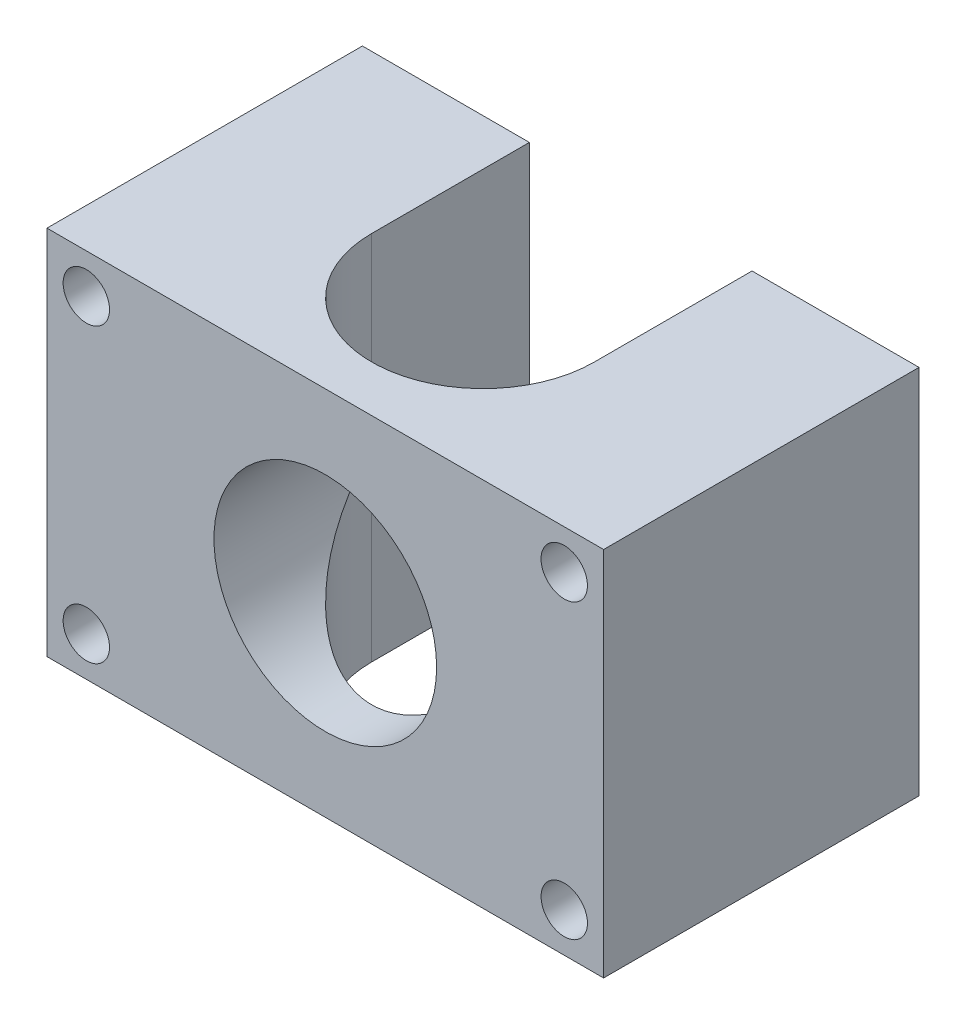
ISO-10303-21;
HEADER;
FILE_DESCRIPTION(('STEP AP214'),'2;1');
FILE_NAME('part.step','',(''),(''),'','','');
FILE_SCHEMA(('AUTOMOTIVE_DESIGN { 1 0 10303 214 1 1 1 1 }'));
ENDSEC;
DATA;
#1=APPLICATION_CONTEXT('core data for automotive mechanical design processes');
#2=APPLICATION_PROTOCOL_DEFINITION('international standard','automotive_design',2000,#1);
#3=PRODUCT_CONTEXT('',#1,'mechanical');
#4=PRODUCT('Part','Part','',(#3));
#5=PRODUCT_RELATED_PRODUCT_CATEGORY('part','',(#4));
#6=PRODUCT_DEFINITION_FORMATION('','',#4);
#7=PRODUCT_DEFINITION_CONTEXT('part definition',#1,'design');
#8=PRODUCT_DEFINITION('design','',#6,#7);
#9=PRODUCT_DEFINITION_SHAPE('','',#8);
#10=(LENGTH_UNIT() NAMED_UNIT(*) SI_UNIT(.MILLI.,.METRE.));
#11=(NAMED_UNIT(*) PLANE_ANGLE_UNIT() SI_UNIT($,.RADIAN.));
#12=(NAMED_UNIT(*) SI_UNIT($,.STERADIAN.) SOLID_ANGLE_UNIT());
#13=UNCERTAINTY_MEASURE_WITH_UNIT(LENGTH_MEASURE(1.E-05),#10,'distance_accuracy_value','');
#14=(GEOMETRIC_REPRESENTATION_CONTEXT(3) GLOBAL_UNCERTAINTY_ASSIGNED_CONTEXT((#13)) GLOBAL_UNIT_ASSIGNED_CONTEXT((#10,
#11,#12)) REPRESENTATION_CONTEXT('',''));
#15=CARTESIAN_POINT('',(0.,0.,0.));
#16=DIRECTION('',(0.,0.,1.));
#17=DIRECTION('',(1.,0.,0.));
#18=AXIS2_PLACEMENT_3D('',#15,#16,#17);
#19=CARTESIAN_POINT('',(0.,0.,0.));
#20=DIRECTION('',(0.,0.,-1.));
#21=DIRECTION('',(-1.,0.,0.));
#22=AXIS2_PLACEMENT_3D('',#19,#20,#21);
#23=PLANE('',#22);
#24=CARTESIAN_POINT('',(55.7573593128807,35.7573593128807,0.));
#25=DIRECTION('',(0.,0.,-1.));
#26=DIRECTION('',(-1.,0.,0.));
#27=AXIS2_PLACEMENT_3D('',#24,#25,#26);
#28=CIRCLE('',#27,2.5);
#29=CARTESIAN_POINT('',(53.2573593128807,35.7573593128807,0.));
#30=VERTEX_POINT('',#29);
#31=EDGE_CURVE('E197',#30,#30,#28,.F.);
#32=ORIENTED_EDGE('',*,*,#31,.T.);
#33=EDGE_LOOP('',(#32));
#34=FACE_BOUND('',#33,.T.);
#35=DIRECTION('',(1.,0.,0.));
#36=VECTOR('',#35,1.);
#37=CARTESIAN_POINT('',(0.,0.,0.));
#38=LINE('',#37,#36);
#39=CARTESIAN_POINT('',(42.,0.,0.));
#40=VERTEX_POINT('',#39);
#41=CARTESIAN_POINT('',(60.,0.,0.));
#42=VERTEX_POINT('',#41);
#43=EDGE_CURVE('E167',#40,#42,#38,.T.);
#44=ORIENTED_EDGE('',*,*,#43,.F.);
#45=DIRECTION('',(0.,-1.,0.));
#46=VECTOR('',#45,1.);
#47=CARTESIAN_POINT('',(42.,40.,0.));
#48=LINE('',#47,#46);
#49=CARTESIAN_POINT('',(42.,40.,0.));
#50=VERTEX_POINT('',#49);
#51=EDGE_CURVE('E144',#50,#40,#48,.T.);
#52=ORIENTED_EDGE('',*,*,#51,.F.);
#53=DIRECTION('',(-1.,0.,0.));
#54=VECTOR('',#53,1.);
#55=CARTESIAN_POINT('',(0.,40.,0.));
#56=LINE('',#55,#54);
#57=CARTESIAN_POINT('',(60.,40.,0.));
#58=VERTEX_POINT('',#57);
#59=EDGE_CURVE('E153',#58,#50,#56,.T.);
#60=ORIENTED_EDGE('',*,*,#59,.F.);
#61=DIRECTION('',(0.,1.,0.));
#62=VECTOR('',#61,1.);
#63=CARTESIAN_POINT('',(60.,0.,0.));
#64=LINE('',#63,#62);
#65=EDGE_CURVE('E172',#42,#58,#64,.T.);
#66=ORIENTED_EDGE('',*,*,#65,.F.);
#67=EDGE_LOOP('',(#44,#52,#60,#66));
#68=FACE_BOUND('',#67,.T.);
#69=CARTESIAN_POINT('',(55.7573593128807,4.24264068711928,0.));
#70=DIRECTION('',(0.,0.,-1.));
#71=DIRECTION('',(-1.,0.,0.));
#72=AXIS2_PLACEMENT_3D('',#69,#70,#71);
#73=CIRCLE('',#72,2.5);
#74=CARTESIAN_POINT('',(53.2573593128807,4.24264068711928,0.));
#75=VERTEX_POINT('',#74);
#76=EDGE_CURVE('E212',#75,#75,#73,.T.);
#77=ORIENTED_EDGE('',*,*,#76,.F.);
#78=EDGE_LOOP('',(#77));
#79=FACE_BOUND('',#78,.T.);
#80=ADVANCED_FACE('F39',(#34,#68,#79),#23,.T.);
#81=CARTESIAN_POINT('',(0.,0.,34.));
#82=DIRECTION('',(0.,0.,-1.));
#83=DIRECTION('',(-1.,0.,0.));
#84=AXIS2_PLACEMENT_3D('',#81,#82,#83);
#85=PLANE('',#84);
#86=CARTESIAN_POINT('',(55.7573593128807,4.24264068711928,34.));
#87=DIRECTION('',(0.,0.,1.));
#88=DIRECTION('',(1.,0.,0.));
#89=AXIS2_PLACEMENT_3D('',#86,#87,#88);
#90=CIRCLE('',#89,2.5);
#91=CARTESIAN_POINT('',(58.2573593128807,4.24264068711928,34.));
#92=VERTEX_POINT('',#91);
#93=EDGE_CURVE('E205',#92,#92,#90,.T.);
#94=ORIENTED_EDGE('',*,*,#93,.F.);
#95=EDGE_LOOP('',(#94));
#96=FACE_BOUND('',#95,.T.);
#97=CARTESIAN_POINT('',(55.7573593128807,35.7573593128807,34.));
#98=DIRECTION('',(0.,0.,-1.));
#99=DIRECTION('',(-1.,0.,0.));
#100=AXIS2_PLACEMENT_3D('',#97,#98,#99);
#101=CIRCLE('',#100,2.5);
#102=CARTESIAN_POINT('',(53.2573593128807,35.7573593128807,34.));
#103=VERTEX_POINT('',#102);
#104=EDGE_CURVE('E328',#103,#103,#101,.T.);
#105=ORIENTED_EDGE('',*,*,#104,.T.);
#106=EDGE_LOOP('',(#105));
#107=FACE_BOUND('',#106,.T.);
#108=CARTESIAN_POINT('',(4.24264068711928,4.24264068711928,34.));
#109=DIRECTION('',(0.,0.,-1.));
#110=DIRECTION('',(-1.,0.,0.));
#111=AXIS2_PLACEMENT_3D('',#108,#109,#110);
#112=CIRCLE('',#111,2.5);
#113=CARTESIAN_POINT('',(1.74264068711928,4.24264068711928,34.));
#114=VERTEX_POINT('',#113);
#115=EDGE_CURVE('E191',#114,#114,#112,.T.);
#116=ORIENTED_EDGE('',*,*,#115,.T.);
#117=EDGE_LOOP('',(#116));
#118=FACE_BOUND('',#117,.T.);
#119=CARTESIAN_POINT('',(30.,20.,34.));
#120=DIRECTION('',(0.,0.,1.));
#121=DIRECTION('',(1.,0.,0.));
#122=AXIS2_PLACEMENT_3D('',#119,#120,#121);
#123=CIRCLE('',#122,12.);
#124=CARTESIAN_POINT('',(42.,20.,34.));
#125=VERTEX_POINT('',#124);
#126=EDGE_CURVE('E116',#125,#125,#123,.T.);
#127=ORIENTED_EDGE('',*,*,#126,.F.);
#128=EDGE_LOOP('',(#127));
#129=FACE_BOUND('',#128,.T.);
#130=DIRECTION('',(0.,-1.,0.));
#131=VECTOR('',#130,1.);
#132=CARTESIAN_POINT('',(0.,0.,34.));
#133=LINE('',#132,#131);
#134=CARTESIAN_POINT('',(0.,40.,34.));
#135=VERTEX_POINT('',#134);
#136=CARTESIAN_POINT('',(0.,0.,34.));
#137=VERTEX_POINT('',#136);
#138=EDGE_CURVE('E148',#135,#137,#133,.T.);
#139=ORIENTED_EDGE('',*,*,#138,.T.);
#140=DIRECTION('',(1.,0.,0.));
#141=VECTOR('',#140,1.);
#142=CARTESIAN_POINT('',(0.,0.,34.));
#143=LINE('',#142,#141);
#144=CARTESIAN_POINT('',(60.,0.,34.));
#145=VERTEX_POINT('',#144);
#146=EDGE_CURVE('E152',#137,#145,#143,.T.);
#147=ORIENTED_EDGE('',*,*,#146,.T.);
#148=DIRECTION('',(0.,1.,0.));
#149=VECTOR('',#148,1.);
#150=CARTESIAN_POINT('',(60.,0.,34.));
#151=LINE('',#150,#149);
#152=CARTESIAN_POINT('',(60.,40.,34.));
#153=VERTEX_POINT('',#152);
#154=EDGE_CURVE('E156',#145,#153,#151,.T.);
#155=ORIENTED_EDGE('',*,*,#154,.T.);
#156=DIRECTION('',(-1.,0.,0.));
#157=VECTOR('',#156,1.);
#158=CARTESIAN_POINT('',(0.,40.,34.));
#159=LINE('',#158,#157);
#160=EDGE_CURVE('E159',#153,#135,#159,.T.);
#161=ORIENTED_EDGE('',*,*,#160,.T.);
#162=EDGE_LOOP('',(#139,#147,#155,#161));
#163=FACE_BOUND('',#162,.T.);
#164=CARTESIAN_POINT('',(4.24264068711928,35.7573593128807,34.));
#165=DIRECTION('',(0.,0.,1.));
#166=DIRECTION('',(1.,0.,0.));
#167=AXIS2_PLACEMENT_3D('',#164,#165,#166);
#168=CIRCLE('',#167,2.5);
#169=CARTESIAN_POINT('',(6.74264068711929,35.7573593128807,34.));
#170=VERTEX_POINT('',#169);
#171=EDGE_CURVE('E199',#170,#170,#168,.T.);
#172=ORIENTED_EDGE('',*,*,#171,.F.);
#173=EDGE_LOOP('',(#172));
#174=FACE_BOUND('',#173,.T.);
#175=ADVANCED_FACE('F267',(#96,#107,#118,#129,#163,#174),#85,.F.);
#176=CARTESIAN_POINT('',(4.24264068711928,4.24264068711928,0.));
#177=DIRECTION('',(0.,0.,-1.));
#178=DIRECTION('',(-1.,0.,0.));
#179=AXIS2_PLACEMENT_3D('',#176,#177,#178);
#180=CIRCLE('',#179,2.5);
#181=CARTESIAN_POINT('',(1.74264068711928,4.24264068711928,0.));
#182=VERTEX_POINT('',#181);
#183=EDGE_CURVE('E188',#182,#182,#180,.F.);
#184=ORIENTED_EDGE('',*,*,#183,.T.);
#185=EDGE_LOOP('',(#184));
#186=FACE_BOUND('',#185,.T.);
#187=DIRECTION('',(0.,-1.,0.));
#188=VECTOR('',#187,1.);
#189=CARTESIAN_POINT('',(18.,40.,0.));
#190=LINE('',#189,#188);
#191=CARTESIAN_POINT('',(18.,40.,0.));
#192=VERTEX_POINT('',#191);
#193=CARTESIAN_POINT('',(18.,0.,0.));
#194=VERTEX_POINT('',#193);
#195=EDGE_CURVE('E64',#192,#194,#190,.T.);
#196=ORIENTED_EDGE('',*,*,#195,.T.);
#197=CARTESIAN_POINT('',(0.,0.,0.));
#198=VERTEX_POINT('',#197);
#199=EDGE_CURVE('E168',#198,#194,#38,.T.);
#200=ORIENTED_EDGE('',*,*,#199,.F.);
#201=DIRECTION('',(0.,-1.,0.));
#202=VECTOR('',#201,1.);
#203=CARTESIAN_POINT('',(0.,0.,0.));
#204=LINE('',#203,#202);
#205=CARTESIAN_POINT('',(0.,40.,0.));
#206=VERTEX_POINT('',#205);
#207=EDGE_CURVE('E163',#206,#198,#204,.T.);
#208=ORIENTED_EDGE('',*,*,#207,.F.);
#209=EDGE_CURVE('E175',#192,#206,#56,.T.);
#210=ORIENTED_EDGE('',*,*,#209,.F.);
#211=EDGE_LOOP('',(#196,#200,#208,#210));
#212=FACE_BOUND('',#211,.T.);
#213=CARTESIAN_POINT('',(4.24264068711928,35.7573593128807,0.));
#214=DIRECTION('',(0.,0.,-1.));
#215=DIRECTION('',(-1.,0.,0.));
#216=AXIS2_PLACEMENT_3D('',#213,#214,#215);
#217=CIRCLE('',#216,2.5);
#218=CARTESIAN_POINT('',(1.74264068711928,35.7573593128807,0.));
#219=VERTEX_POINT('',#218);
#220=EDGE_CURVE('E43',#219,#219,#217,.T.);
#221=ORIENTED_EDGE('',*,*,#220,.F.);
#222=EDGE_LOOP('',(#221));
#223=FACE_BOUND('',#222,.T.);
#224=ADVANCED_FACE('F251',(#186,#212,#223),#23,.T.);
#225=CARTESIAN_POINT('',(30.,40.,17.));
#226=DIRECTION('',(0.,-1.,0.));
#227=DIRECTION('',(0.,0.,-1.));
#228=AXIS2_PLACEMENT_3D('',#225,#226,#227);
#229=CYLINDRICAL_SURFACE('',#228,12.);
#230=DIRECTION('',(0.,-1.,0.));
#231=VECTOR('',#230,1.);
#232=CARTESIAN_POINT('',(42.,40.,17.));
#233=LINE('',#232,#231);
#234=CARTESIAN_POINT('',(42.,40.,17.));
#235=VERTEX_POINT('',#234);
#236=CARTESIAN_POINT('',(42.,20.,17.));
#237=VERTEX_POINT('',#236);
#238=EDGE_CURVE('E125',#235,#237,#233,.T.);
#239=ORIENTED_EDGE('',*,*,#238,.T.);
#240=CARTESIAN_POINT('',(30.,20.,17.));
#241=DIRECTION('',(0.,-0.707106781186547,0.707106781186547));
#242=DIRECTION('',(0.,-0.707106781186547,-0.707106781186547));
#243=AXIS2_PLACEMENT_3D('',#240,#241,#242);
#244=ELLIPSE('',#243,16.9705627484771,12.);
#245=CARTESIAN_POINT('',(18.,20.,17.));
#246=VERTEX_POINT('',#245);
#247=EDGE_CURVE('E56',#237,#246,#244,.T.);
#248=ORIENTED_EDGE('',*,*,#247,.T.);
#249=DIRECTION('',(0.,-1.,0.));
#250=VECTOR('',#249,1.);
#251=CARTESIAN_POINT('',(18.,40.,17.));
#252=LINE('',#251,#250);
#253=CARTESIAN_POINT('',(18.,40.,17.));
#254=VERTEX_POINT('',#253);
#255=EDGE_CURVE('E123',#254,#246,#252,.T.);
#256=ORIENTED_EDGE('',*,*,#255,.F.);
#257=CARTESIAN_POINT('',(30.,40.,17.));
#258=DIRECTION('',(0.,-1.,0.));
#259=DIRECTION('',(0.,0.,-1.));
#260=AXIS2_PLACEMENT_3D('',#257,#258,#259);
#261=CIRCLE('',#260,12.);
#262=EDGE_CURVE('E219',#235,#254,#261,.T.);
#263=ORIENTED_EDGE('',*,*,#262,.F.);
#264=EDGE_LOOP('',(#239,#248,#256,#263));
#265=FACE_BOUND('',#264,.T.);
#266=ADVANCED_FACE('F120',(#265),#229,.F.);
#267=CARTESIAN_POINT('',(0.,0.,34.));
#268=DIRECTION('',(0.,1.,0.));
#269=DIRECTION('',(0.,0.,1.));
#270=AXIS2_PLACEMENT_3D('',#267,#268,#269);
#271=PLANE('',#270);
#272=DIRECTION('',(0.,0.,-1.));
#273=VECTOR('',#272,1.);
#274=CARTESIAN_POINT('',(42.,0.,0.));
#275=LINE('',#274,#273);
#276=CARTESIAN_POINT('',(42.,0.,17.));
#277=VERTEX_POINT('',#276);
#278=EDGE_CURVE('E222',#277,#40,#275,.T.);
#279=ORIENTED_EDGE('',*,*,#278,.T.);
#280=ORIENTED_EDGE('',*,*,#43,.T.);
#281=DIRECTION('',(0.,0.,-1.));
#282=VECTOR('',#281,1.);
#283=CARTESIAN_POINT('',(60.,0.,34.));
#284=LINE('',#283,#282);
#285=EDGE_CURVE('E49',#145,#42,#284,.T.);
#286=ORIENTED_EDGE('',*,*,#285,.F.);
#287=ORIENTED_EDGE('',*,*,#146,.F.);
#288=DIRECTION('',(0.,0.,-1.));
#289=VECTOR('',#288,1.);
#290=CARTESIAN_POINT('',(0.,0.,34.));
#291=LINE('',#290,#289);
#292=EDGE_CURVE('E11',#137,#198,#291,.T.);
#293=ORIENTED_EDGE('',*,*,#292,.T.);
#294=ORIENTED_EDGE('',*,*,#199,.T.);
#295=DIRECTION('',(0.,0.,-1.));
#296=VECTOR('',#295,1.);
#297=CARTESIAN_POINT('',(18.,0.,0.));
#298=LINE('',#297,#296);
#299=CARTESIAN_POINT('',(18.,0.,17.));
#300=VERTEX_POINT('',#299);
#301=EDGE_CURVE('E229',#300,#194,#298,.T.);
#302=ORIENTED_EDGE('',*,*,#301,.F.);
#303=CARTESIAN_POINT('',(30.,0.,17.));
#304=DIRECTION('',(0.,-1.,0.));
#305=DIRECTION('',(0.,0.,-1.));
#306=AXIS2_PLACEMENT_3D('',#303,#304,#305);
#307=CIRCLE('',#306,12.);
#308=EDGE_CURVE('E127',#277,#300,#307,.T.);
#309=ORIENTED_EDGE('',*,*,#308,.F.);
#310=EDGE_LOOP('',(#279,#280,#286,#287,#293,#294,#302,#309));
#311=FACE_BOUND('',#310,.T.);
#312=ADVANCED_FACE('F245',(#311),#271,.F.);
#313=CARTESIAN_POINT('',(0.,40.,34.));
#314=DIRECTION('',(0.,-1.,0.));
#315=DIRECTION('',(0.,0.,-1.));
#316=AXIS2_PLACEMENT_3D('',#313,#314,#315);
#317=PLANE('',#316);
#318=DIRECTION('',(0.,0.,-1.));
#319=VECTOR('',#318,1.);
#320=CARTESIAN_POINT('',(42.,40.,0.));
#321=LINE('',#320,#319);
#322=EDGE_CURVE('E136',#235,#50,#321,.T.);
#323=ORIENTED_EDGE('',*,*,#322,.F.);
#324=ORIENTED_EDGE('',*,*,#262,.T.);
#325=DIRECTION('',(0.,0.,-1.));
#326=VECTOR('',#325,1.);
#327=CARTESIAN_POINT('',(18.,40.,0.));
#328=LINE('',#327,#326);
#329=EDGE_CURVE('E140',#254,#192,#328,.T.);
#330=ORIENTED_EDGE('',*,*,#329,.T.);
#331=ORIENTED_EDGE('',*,*,#209,.T.);
#332=DIRECTION('',(0.,0.,-1.));
#333=VECTOR('',#332,1.);
#334=CARTESIAN_POINT('',(0.,40.,34.));
#335=LINE('',#334,#333);
#336=EDGE_CURVE('E162',#135,#206,#335,.T.);
#337=ORIENTED_EDGE('',*,*,#336,.F.);
#338=ORIENTED_EDGE('',*,*,#160,.F.);
#339=DIRECTION('',(0.,0.,-1.));
#340=VECTOR('',#339,1.);
#341=CARTESIAN_POINT('',(60.,40.,34.));
#342=LINE('',#341,#340);
#343=EDGE_CURVE('E182',#153,#58,#342,.T.);
#344=ORIENTED_EDGE('',*,*,#343,.T.);
#345=ORIENTED_EDGE('',*,*,#59,.T.);
#346=EDGE_LOOP('',(#323,#324,#330,#331,#337,#338,#344,#345));
#347=FACE_BOUND('',#346,.T.);
#348=ADVANCED_FACE('F248',(#347),#317,.F.);
#349=CARTESIAN_POINT('',(0.,0.,34.));
#350=DIRECTION('',(1.,0.,0.));
#351=DIRECTION('',(0.,0.,-1.));
#352=AXIS2_PLACEMENT_3D('',#349,#350,#351);
#353=PLANE('',#352);
#354=ORIENTED_EDGE('',*,*,#207,.T.);
#355=ORIENTED_EDGE('',*,*,#292,.F.);
#356=ORIENTED_EDGE('',*,*,#138,.F.);
#357=ORIENTED_EDGE('',*,*,#336,.T.);
#358=EDGE_LOOP('',(#354,#355,#356,#357));
#359=FACE_BOUND('',#358,.T.);
#360=ADVANCED_FACE('F41',(#359),#353,.F.);
#361=CARTESIAN_POINT('',(60.,0.,34.));
#362=DIRECTION('',(-1.,0.,0.));
#363=DIRECTION('',(0.,0.,1.));
#364=AXIS2_PLACEMENT_3D('',#361,#362,#363);
#365=PLANE('',#364);
#366=ORIENTED_EDGE('',*,*,#65,.T.);
#367=ORIENTED_EDGE('',*,*,#343,.F.);
#368=ORIENTED_EDGE('',*,*,#154,.F.);
#369=ORIENTED_EDGE('',*,*,#285,.T.);
#370=EDGE_LOOP('',(#366,#367,#368,#369));
#371=FACE_BOUND('',#370,.T.);
#372=ADVANCED_FACE('F260',(#371),#365,.F.);
#373=EDGE_CURVE('E130',#246,#300,#252,.T.);
#374=ORIENTED_EDGE('',*,*,#373,.F.);
#375=CARTESIAN_POINT('',(30.,20.,17.));
#376=DIRECTION('',(0.,-0.707106781186547,-0.707106781186547));
#377=DIRECTION('',(0.,-0.707106781186547,0.707106781186547));
#378=AXIS2_PLACEMENT_3D('',#375,#376,#377);
#379=ELLIPSE('',#378,16.9705627484771,12.);
#380=EDGE_CURVE('E110',#246,#237,#379,.F.);
#381=ORIENTED_EDGE('',*,*,#380,.T.);
#382=EDGE_CURVE('E236',#237,#277,#233,.T.);
#383=ORIENTED_EDGE('',*,*,#382,.T.);
#384=ORIENTED_EDGE('',*,*,#308,.T.);
#385=EDGE_LOOP('',(#374,#381,#383,#384));
#386=FACE_BOUND('',#385,.T.);
#387=ADVANCED_FACE('F131',(#386),#229,.F.);
#388=CARTESIAN_POINT('',(42.,40.,0.));
#389=DIRECTION('',(-1.,0.,0.));
#390=DIRECTION('',(0.,0.,1.));
#391=AXIS2_PLACEMENT_3D('',#388,#389,#390);
#392=PLANE('',#391);
#393=ORIENTED_EDGE('',*,*,#382,.F.);
#394=ORIENTED_EDGE('',*,*,#238,.F.);
#395=ORIENTED_EDGE('',*,*,#322,.T.);
#396=ORIENTED_EDGE('',*,*,#51,.T.);
#397=ORIENTED_EDGE('',*,*,#278,.F.);
#398=EDGE_LOOP('',(#393,#394,#395,#396,#397));
#399=FACE_BOUND('',#398,.T.);
#400=ADVANCED_FACE('F242',(#399),#392,.T.);
#401=CARTESIAN_POINT('',(18.,40.,0.));
#402=DIRECTION('',(-1.,0.,0.));
#403=DIRECTION('',(0.,0.,1.));
#404=AXIS2_PLACEMENT_3D('',#401,#402,#403);
#405=PLANE('',#404);
#406=ORIENTED_EDGE('',*,*,#301,.T.);
#407=ORIENTED_EDGE('',*,*,#195,.F.);
#408=ORIENTED_EDGE('',*,*,#329,.F.);
#409=ORIENTED_EDGE('',*,*,#255,.T.);
#410=ORIENTED_EDGE('',*,*,#373,.T.);
#411=EDGE_LOOP('',(#406,#407,#408,#409,#410));
#412=FACE_BOUND('',#411,.T.);
#413=ADVANCED_FACE('F138',(#412),#405,.F.);
#414=CARTESIAN_POINT('',(30.,20.,-6.));
#415=DIRECTION('',(0.,0.,1.));
#416=DIRECTION('',(1.,0.,0.));
#417=AXIS2_PLACEMENT_3D('',#414,#415,#416);
#418=CYLINDRICAL_SURFACE('',#417,12.);
#419=ORIENTED_EDGE('',*,*,#126,.T.);
#420=EDGE_LOOP('',(#419));
#421=FACE_BOUND('',#420,.T.);
#422=ORIENTED_EDGE('',*,*,#380,.F.);
#423=ORIENTED_EDGE('',*,*,#247,.F.);
#424=EDGE_LOOP('',(#422,#423));
#425=FACE_BOUND('',#424,.T.);
#426=ADVANCED_FACE('F111',(#421,#425),#418,.F.);
#427=CARTESIAN_POINT('',(4.24264068711928,4.24264068711928,-6.));
#428=DIRECTION('',(0.,0.,1.));
#429=DIRECTION('',(1.,0.,0.));
#430=AXIS2_PLACEMENT_3D('',#427,#428,#429);
#431=CYLINDRICAL_SURFACE('',#430,2.5);
#432=ORIENTED_EDGE('',*,*,#183,.F.);
#433=EDGE_LOOP('',(#432));
#434=FACE_BOUND('',#433,.T.);
#435=ORIENTED_EDGE('',*,*,#115,.F.);
#436=EDGE_LOOP('',(#435));
#437=FACE_BOUND('',#436,.T.);
#438=ADVANCED_FACE('F306',(#434,#437),#431,.F.);
#439=CARTESIAN_POINT('',(4.24264068711928,35.7573593128807,-6.));
#440=DIRECTION('',(0.,0.,1.));
#441=DIRECTION('',(1.,0.,0.));
#442=AXIS2_PLACEMENT_3D('',#439,#440,#441);
#443=CYLINDRICAL_SURFACE('',#442,2.5);
#444=ORIENTED_EDGE('',*,*,#220,.T.);
#445=EDGE_LOOP('',(#444));
#446=FACE_BOUND('',#445,.T.);
#447=ORIENTED_EDGE('',*,*,#171,.T.);
#448=EDGE_LOOP('',(#447));
#449=FACE_BOUND('',#448,.T.);
#450=ADVANCED_FACE('F310',(#446,#449),#443,.F.);
#451=CARTESIAN_POINT('',(55.7573593128807,35.7573593128807,-6.));
#452=DIRECTION('',(0.,0.,1.));
#453=DIRECTION('',(1.,0.,0.));
#454=AXIS2_PLACEMENT_3D('',#451,#452,#453);
#455=CYLINDRICAL_SURFACE('',#454,2.5);
#456=ORIENTED_EDGE('',*,*,#31,.F.);
#457=EDGE_LOOP('',(#456));
#458=FACE_BOUND('',#457,.T.);
#459=ORIENTED_EDGE('',*,*,#104,.F.);
#460=EDGE_LOOP('',(#459));
#461=FACE_BOUND('',#460,.T.);
#462=ADVANCED_FACE('F315',(#458,#461),#455,.F.);
#463=CARTESIAN_POINT('',(55.7573593128807,4.24264068711928,-6.));
#464=DIRECTION('',(0.,0.,1.));
#465=DIRECTION('',(1.,0.,0.));
#466=AXIS2_PLACEMENT_3D('',#463,#464,#465);
#467=CYLINDRICAL_SURFACE('',#466,2.5);
#468=ORIENTED_EDGE('',*,*,#76,.T.);
#469=EDGE_LOOP('',(#468));
#470=FACE_BOUND('',#469,.T.);
#471=ORIENTED_EDGE('',*,*,#93,.T.);
#472=EDGE_LOOP('',(#471));
#473=FACE_BOUND('',#472,.T.);
#474=ADVANCED_FACE('F312',(#470,#473),#467,.F.);
#475=CLOSED_SHELL('',(#80,#175,#224,#266,#312,#348,#360,#372,#387,#400,#413,#426,#438,#450,#462,#474));
#476=MANIFOLD_SOLID_BREP('B2',#475);
#477=ADVANCED_BREP_SHAPE_REPRESENTATION('',(#18,#476),#14);
#478=SHAPE_DEFINITION_REPRESENTATION(#9,#477);
ENDSEC;
END-ISO-10303-21;
